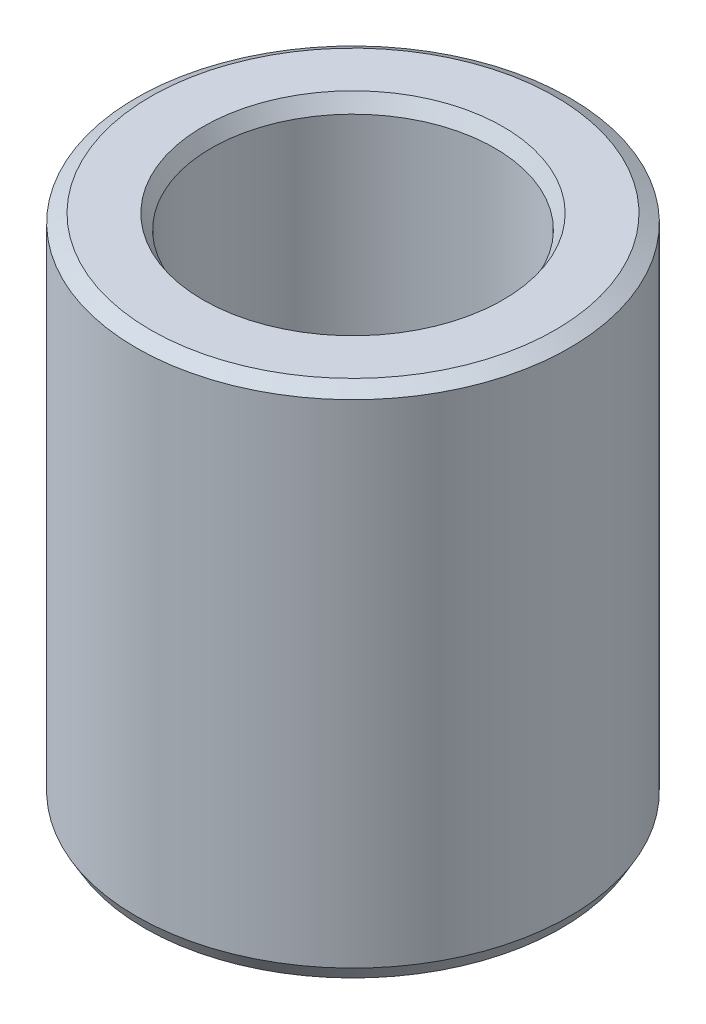
ISO-10303-21;
HEADER;
FILE_DESCRIPTION(('STEP AP214'),'2;1');
FILE_NAME('part.step','',(''),(''),'','','');
FILE_SCHEMA(('AUTOMOTIVE_DESIGN { 1 0 10303 214 1 1 1 1 }'));
ENDSEC;
DATA;
#1=APPLICATION_CONTEXT('core data for automotive mechanical design processes');
#2=APPLICATION_PROTOCOL_DEFINITION('international standard','automotive_design',2000,#1);
#3=PRODUCT_CONTEXT('',#1,'mechanical');
#4=PRODUCT('Part','Part','',(#3));
#5=PRODUCT_RELATED_PRODUCT_CATEGORY('part','',(#4));
#6=PRODUCT_DEFINITION_FORMATION('','',#4);
#7=PRODUCT_DEFINITION_CONTEXT('part definition',#1,'design');
#8=PRODUCT_DEFINITION('design','',#6,#7);
#9=PRODUCT_DEFINITION_SHAPE('','',#8);
#10=(LENGTH_UNIT() NAMED_UNIT(*) SI_UNIT(.MILLI.,.METRE.));
#11=(NAMED_UNIT(*) PLANE_ANGLE_UNIT() SI_UNIT($,.RADIAN.));
#12=(NAMED_UNIT(*) SI_UNIT($,.STERADIAN.) SOLID_ANGLE_UNIT());
#13=UNCERTAINTY_MEASURE_WITH_UNIT(LENGTH_MEASURE(1.E-05),#10,'distance_accuracy_value','');
#14=(GEOMETRIC_REPRESENTATION_CONTEXT(3) GLOBAL_UNCERTAINTY_ASSIGNED_CONTEXT((#13)) GLOBAL_UNIT_ASSIGNED_CONTEXT((#10,
#11,#12)) REPRESENTATION_CONTEXT('',''));
#15=CARTESIAN_POINT('',(0.,0.,0.));
#16=DIRECTION('',(0.,0.,1.));
#17=DIRECTION('',(1.,0.,0.));
#18=AXIS2_PLACEMENT_3D('',#15,#16,#17);
#19=CARTESIAN_POINT('',(0.,130.741757189892,0.));
#20=DIRECTION('',(0.,-1.,0.));
#21=DIRECTION('',(0.,0.,-1.));
#22=AXIS2_PLACEMENT_3D('',#19,#20,#21);
#23=CYLINDRICAL_SURFACE('',#22,55.);
#24=CARTESIAN_POINT('',(0.,3.65298031616579,0.));
#25=DIRECTION('',(0.,1.,0.));
#26=DIRECTION('',(0.,0.,1.));
#27=AXIS2_PLACEMENT_3D('',#24,#25,#26);
#28=CIRCLE('',#27,55.);
#29=CARTESIAN_POINT('',(0.,3.65298031616579,55.));
#30=VERTEX_POINT('',#29);
#31=EDGE_CURVE('E10',#30,#30,#28,.T.);
#32=ORIENTED_EDGE('',*,*,#31,.T.);
#33=EDGE_LOOP('',(#32));
#34=FACE_BOUND('',#33,.T.);
#35=CARTESIAN_POINT('',(0.,128.632708021009,0.));
#36=DIRECTION('',(0.,1.,0.));
#37=DIRECTION('',(0.,0.,1.));
#38=AXIS2_PLACEMENT_3D('',#35,#36,#37);
#39=CIRCLE('',#38,55.);
#40=CARTESIAN_POINT('',(0.,128.632708021009,55.));
#41=VERTEX_POINT('',#40);
#42=EDGE_CURVE('E50',#41,#41,#39,.F.);
#43=ORIENTED_EDGE('',*,*,#42,.T.);
#44=EDGE_LOOP('',(#43));
#45=FACE_BOUND('',#44,.T.);
#46=ADVANCED_FACE('F39',(#34,#45),#23,.T.);
#47=CARTESIAN_POINT('',(0.,130.741757189892,0.));
#48=DIRECTION('',(0.,1.,0.));
#49=DIRECTION('',(0.,0.,1.));
#50=AXIS2_PLACEMENT_3D('',#47,#48,#49);
#51=PLANE('',#50);
#52=CARTESIAN_POINT('',(0.,130.741757189892,0.));
#53=DIRECTION('',(0.,1.,0.));
#54=DIRECTION('',(0.,0.,1.));
#55=AXIS2_PLACEMENT_3D('',#52,#53,#54);
#56=CIRCLE('',#55,38.0900434765867);
#57=CARTESIAN_POINT('',(0.,130.741757189891,38.0900434765867));
#58=VERTEX_POINT('',#57);
#59=EDGE_CURVE('E58',#58,#58,#56,.F.);
#60=ORIENTED_EDGE('',*,*,#59,.T.);
#61=EDGE_LOOP('',(#60));
#62=FACE_BOUND('',#61,.T.);
#63=CARTESIAN_POINT('',(0.,130.741757189892,0.));
#64=DIRECTION('',(0.,1.,0.));
#65=DIRECTION('',(0.,0.,1.));
#66=AXIS2_PLACEMENT_3D('',#63,#64,#65);
#67=CIRCLE('',#66,51.3470196838343);
#68=CARTESIAN_POINT('',(0.,130.741757189892,51.3470196838343));
#69=VERTEX_POINT('',#68);
#70=EDGE_CURVE('E61',#69,#69,#67,.T.);
#71=ORIENTED_EDGE('',*,*,#70,.T.);
#72=EDGE_LOOP('',(#71));
#73=FACE_BOUND('',#72,.T.);
#74=ADVANCED_FACE('F88',(#62,#73),#51,.T.);
#75=CARTESIAN_POINT('',(0.,0.,0.));
#76=DIRECTION('',(0.,1.,0.));
#77=DIRECTION('',(0.,0.,1.));
#78=AXIS2_PLACEMENT_3D('',#75,#76,#77);
#79=PLANE('',#78);
#80=CARTESIAN_POINT('',(0.,0.,0.));
#81=DIRECTION('',(0.,1.,0.));
#82=DIRECTION('',(0.,0.,1.));
#83=AXIS2_PLACEMENT_3D('',#80,#81,#82);
#84=CIRCLE('',#83,39.6339746238697);
#85=CARTESIAN_POINT('',(0.,0.,39.6339746238697));
#86=VERTEX_POINT('',#85);
#87=EDGE_CURVE('E51',#86,#86,#84,.T.);
#88=ORIENTED_EDGE('',*,*,#87,.T.);
#89=EDGE_LOOP('',(#88));
#90=FACE_BOUND('',#89,.T.);
#91=CARTESIAN_POINT('',(0.,0.,0.));
#92=DIRECTION('',(0.,1.,0.));
#93=DIRECTION('',(0.,0.,1.));
#94=AXIS2_PLACEMENT_3D('',#91,#92,#93);
#95=CIRCLE('',#94,52.8909508311173);
#96=CARTESIAN_POINT('',(0.,0.,52.8909508311173));
#97=VERTEX_POINT('',#96);
#98=EDGE_CURVE('E54',#97,#97,#95,.F.);
#99=ORIENTED_EDGE('',*,*,#98,.T.);
#100=EDGE_LOOP('',(#99));
#101=FACE_BOUND('',#100,.T.);
#102=ADVANCED_FACE('F83',(#90,#101),#79,.F.);
#103=CARTESIAN_POINT('',(0.,130.741757189892,0.));
#104=DIRECTION('',(0.,-1.,0.));
#105=DIRECTION('',(0.,0.,-1.));
#106=AXIS2_PLACEMENT_3D('',#103,#104,#105);
#107=CYLINDRICAL_SURFACE('',#106,35.980994307704);
#108=CARTESIAN_POINT('',(0.,127.088776873726,0.));
#109=DIRECTION('',(0.,1.,0.));
#110=DIRECTION('',(0.,0.,1.));
#111=AXIS2_PLACEMENT_3D('',#108,#109,#110);
#112=CIRCLE('',#111,35.980994307704);
#113=CARTESIAN_POINT('',(0.,127.088776873726,35.980994307704));
#114=VERTEX_POINT('',#113);
#115=EDGE_CURVE('E67',#114,#114,#112,.T.);
#116=ORIENTED_EDGE('',*,*,#115,.T.);
#117=EDGE_LOOP('',(#116));
#118=FACE_BOUND('',#117,.T.);
#119=CARTESIAN_POINT('',(0.,2.10904916888272,0.));
#120=DIRECTION('',(0.,1.,0.));
#121=DIRECTION('',(0.,0.,1.));
#122=AXIS2_PLACEMENT_3D('',#119,#120,#121);
#123=CIRCLE('',#122,35.980994307704);
#124=CARTESIAN_POINT('',(0.,2.10904916888272,35.980994307704));
#125=VERTEX_POINT('',#124);
#126=EDGE_CURVE('E69',#125,#125,#123,.F.);
#127=ORIENTED_EDGE('',*,*,#126,.T.);
#128=EDGE_LOOP('',(#127));
#129=FACE_BOUND('',#128,.T.);
#130=ADVANCED_FACE('F71',(#118,#129),#107,.F.);
#131=CARTESIAN_POINT('',(0.,127.088776873726,0.));
#132=DIRECTION('',(0.,1.,0.));
#133=DIRECTION('',(0.,0.,1.));
#134=AXIS2_PLACEMENT_3D('',#131,#132,#133);
#135=CONICAL_SURFACE('',#134,35.980994307704,0.523598775598302);
#136=CARTESIAN_POINT('',(0.,130.741757189891,38.0900434765867));
#137=CARTESIAN_POINT('',(0.,130.703705311598,38.0680742144109));
#138=CARTESIAN_POINT('',(0.,130.665653433305,38.046104952235));
#139=CARTESIAN_POINT('',(0.,130.589549676718,38.0021664278833));
#140=CARTESIAN_POINT('',(0.,130.551497798425,37.9801971657074));
#141=CARTESIAN_POINT('',(0.,130.475394041838,37.9362586413557));
#142=CARTESIAN_POINT('',(0.,130.437342163544,37.9142893791798));
#143=CARTESIAN_POINT('',(0.,130.361238406958,37.8703508548281));
#144=CARTESIAN_POINT('',(0.,130.323186528664,37.8483815926523));
#145=CARTESIAN_POINT('',(0.,130.247082772077,37.8044430683005));
#146=CARTESIAN_POINT('',(0.,130.209030893784,37.7824738061247));
#147=CARTESIAN_POINT('',(0.,130.132927137197,37.7385352817729));
#148=CARTESIAN_POINT('',(0.,130.094875258904,37.7165660195971));
#149=CARTESIAN_POINT('',(0.,130.018771502317,37.6726274952454));
#150=CARTESIAN_POINT('',(0.,129.980719624024,37.6506582330695));
#151=CARTESIAN_POINT('',(0.,129.904615867437,37.6067197087178));
#152=CARTESIAN_POINT('',(0.,129.866563989143,37.5847504465419));
#153=CARTESIAN_POINT('',(0.,129.790460232557,37.5408119221902));
#154=CARTESIAN_POINT('',(0.,129.752408354263,37.5188426600143));
#155=CARTESIAN_POINT('',(0.,129.676304597676,37.4749041356626));
#156=CARTESIAN_POINT('',(0.,129.638252719383,37.4529348734867));
#157=CARTESIAN_POINT('',(0.,129.562148962796,37.408996349135));
#158=CARTESIAN_POINT('',(0.,129.524097084503,37.3870270869592));
#159=CARTESIAN_POINT('',(0.,129.447993327916,37.3430885626074));
#160=CARTESIAN_POINT('',(0.,129.409941449623,37.3211193004316));
#161=CARTESIAN_POINT('',(0.,129.333837693036,37.2771807760799));
#162=CARTESIAN_POINT('',(0.,129.295785814743,37.255211513904));
#163=CARTESIAN_POINT('',(0.,129.219682058156,37.2112729895523));
#164=CARTESIAN_POINT('',(0.,129.181630179862,37.1893037273764));
#165=CARTESIAN_POINT('',(0.,129.105526423276,37.1453652030247));
#166=CARTESIAN_POINT('',(0.,129.067474544982,37.1233959408488));
#167=CARTESIAN_POINT('',(0.,128.991370788395,37.0794574164971));
#168=CARTESIAN_POINT('',(0.,128.953318910102,37.0574881543212));
#169=CARTESIAN_POINT('',(0.,128.877215153515,37.0135496299695));
#170=CARTESIAN_POINT('',(0.,128.839163275222,36.9915803677936));
#171=CARTESIAN_POINT('',(0.,128.763059518635,36.9476418434419));
#172=CARTESIAN_POINT('',(0.,128.725007640342,36.9256725812661));
#173=CARTESIAN_POINT('',(0.,128.648903883755,36.8817340569143));
#174=CARTESIAN_POINT('',(0.,128.610852005461,36.8597647947385));
#175=CARTESIAN_POINT('',(0.,128.534748248875,36.8158262703868));
#176=CARTESIAN_POINT('',(0.,128.496696370581,36.7938570082109));
#177=CARTESIAN_POINT('',(0.,128.420592613994,36.7499184838592));
#178=CARTESIAN_POINT('',(0.,128.382540735701,36.7279492216833));
#179=CARTESIAN_POINT('',(0.,128.306436979114,36.6840106973316));
#180=CARTESIAN_POINT('',(0.,128.268385100821,36.6620414351557));
#181=CARTESIAN_POINT('',(0.,128.192281344234,36.618102910804));
#182=CARTESIAN_POINT('',(0.,128.154229465941,36.5961336486281));
#183=CARTESIAN_POINT('',(0.,128.078125709354,36.5521951242764));
#184=CARTESIAN_POINT('',(0.,128.040073831061,36.5302258621006));
#185=CARTESIAN_POINT('',(0.,127.963970074474,36.4862873377488));
#186=CARTESIAN_POINT('',(0.,127.92591819618,36.464318075573));
#187=CARTESIAN_POINT('',(0.,127.849814439594,36.4203795512212));
#188=CARTESIAN_POINT('',(0.,127.8117625613,36.3984102890454));
#189=CARTESIAN_POINT('',(0.,127.735658804713,36.3544717646937));
#190=CARTESIAN_POINT('',(0.,127.69760692642,36.3325025025178));
#191=CARTESIAN_POINT('',(0.,127.621503169833,36.2885639781661));
#192=CARTESIAN_POINT('',(0.,127.58345129154,36.2665947159902));
#193=CARTESIAN_POINT('',(0.,127.507347534953,36.2226561916385));
#194=CARTESIAN_POINT('',(0.,127.46929565666,36.2006869294626));
#195=CARTESIAN_POINT('',(0.,127.393191900073,36.1567484051109));
#196=CARTESIAN_POINT('',(0.,127.355140021779,36.134779142935));
#197=CARTESIAN_POINT('',(0.,127.279036265193,36.0908406185833));
#198=CARTESIAN_POINT('',(0.,127.240984386899,36.0688713564074));
#199=CARTESIAN_POINT('',(0.,127.164880630312,36.0249328320557));
#200=CARTESIAN_POINT('',(0.,127.126828752019,36.0029635698799));
#201=CARTESIAN_POINT('',(0.,127.088776873726,35.980994307704));
#202=B_SPLINE_CURVE_WITH_KNOTS('',3,(#136,#137,#138,#139,#140,#141,#142,#143,#144,#145,#146,
#147,#148,#149,#150,#151,#152,#153,#154,#155,#156,#157,#158,#159,#160,#161,#162,#163,#164,#165,
#166,#167,#168,#169,#170,#171,#172,#173,#174,#175,#176,#177,#178,#179,#180,#181,#182,#183,#184,
#185,#186,#187,#188,#189,#190,#191,#192,#193,#194,#195,#196,#197,#198,#199,#200,#201),
.UNSPECIFIED.,.F.,.F.,(4,2,2,2,2,2,2,2,2,2,2,2,2,2,2,2,2,2,2,2,2,2,2,2,2,2,2,2,2,2,2,2,4),(0.,
0.131815573055173,0.263631146110342,0.395446719165511,0.52726229222068,0.659077865275853,
0.790893438331022,0.922709011386194,1.05452458444136,1.18634015749653,1.31815573055171,
1.44997130360687,1.58178687666204,1.71360244971722,1.84541802277239,1.97723359582756,
2.10904916888273,2.2408647419379,2.37268031499307,2.50449588804824,2.63631146110341,
2.76812703415858,2.89994260721375,3.03175818026892,3.16357375332409,3.29538932637926,
3.42720489943443,3.5590204724896,3.69083604554477,3.82265161859994,3.95446719165511,
4.08628276471028,4.21809833776543),.UNSPECIFIED.);
#203=EDGE_CURVE('BSEAM77',#58,#114,#202,.T.);
#204=ORIENTED_EDGE('',*,*,#59,.F.);
#205=ORIENTED_EDGE('',*,*,#115,.F.);
#206=ORIENTED_EDGE('',*,*,#203,.T.);
#207=ORIENTED_EDGE('',*,*,#203,.F.);
#208=EDGE_LOOP('',(#204,#206,#205,#207));
#209=FACE_BOUND('',#208,.T.);
#210=ADVANCED_FACE('F77',(#209),#135,.F.);
#211=CARTESIAN_POINT('',(0.,0.,0.));
#212=DIRECTION('',(0.,-1.,0.));
#213=DIRECTION('',(0.,0.,-1.));
#214=AXIS2_PLACEMENT_3D('',#211,#212,#213);
#215=CONICAL_SURFACE('',#214,39.6339746238697,1.04719755119659);
#216=ORIENTED_EDGE('',*,*,#126,.F.);
#217=EDGE_LOOP('',(#216));
#218=FACE_BOUND('',#217,.T.);
#219=ORIENTED_EDGE('',*,*,#87,.F.);
#220=EDGE_LOOP('',(#219));
#221=FACE_BOUND('',#220,.T.);
#222=ADVANCED_FACE('F73',(#218,#221),#215,.F.);
#223=CARTESIAN_POINT('',(0.,3.65298031616579,0.));
#224=DIRECTION('',(0.,1.,0.));
#225=DIRECTION('',(0.,0.,1.));
#226=AXIS2_PLACEMENT_3D('',#223,#224,#225);
#227=CONICAL_SURFACE('',#226,55.,0.5235987755983);
#228=CARTESIAN_POINT('',(0.,0.,52.8909508311173));
#229=CARTESIAN_POINT('',(0.,0.0380518782933947,52.9129200932931));
#230=CARTESIAN_POINT('',(0.,0.0761037565867878,52.934889355469));
#231=CARTESIAN_POINT('',(0.,0.152207513173574,52.9788278798207));
#232=CARTESIAN_POINT('',(0.,0.190259391466967,53.0007971419966));
#233=CARTESIAN_POINT('',(0.,0.266363148053754,53.0447356663483));
#234=CARTESIAN_POINT('',(0.,0.304415026347148,53.0667049285242));
#235=CARTESIAN_POINT('',(0.,0.380518782933936,53.1106434528759));
#236=CARTESIAN_POINT('',(0.,0.418570661227329,53.1326127150517));
#237=CARTESIAN_POINT('',(0.,0.494674417814117,53.1765512394035));
#238=CARTESIAN_POINT('',(0.,0.532726296107511,53.1985205015793));
#239=CARTESIAN_POINT('',(0.,0.608830052694298,53.2424590259311));
#240=CARTESIAN_POINT('',(0.,0.646881930987691,53.2644282881069));
#241=CARTESIAN_POINT('',(0.,0.722985687574478,53.3083668124586));
#242=CARTESIAN_POINT('',(0.,0.761037565867872,53.3303360746345));
#243=CARTESIAN_POINT('',(0.,0.83714132245466,53.3742745989862));
#244=CARTESIAN_POINT('',(0.,0.875193200748054,53.3962438611621));
#245=CARTESIAN_POINT('',(0.,0.951296957334841,53.4401823855138));
#246=CARTESIAN_POINT('',(0.,0.989348835628233,53.4621516476897));
#247=CARTESIAN_POINT('',(0.,1.06545259221502,53.5060901720414));
#248=CARTESIAN_POINT('',(0.,1.10350447050841,53.5280594342173));
#249=CARTESIAN_POINT('',(0.,1.1796082270952,53.571997958569));
#250=CARTESIAN_POINT('',(0.,1.2176601053886,53.5939672207448));
#251=CARTESIAN_POINT('',(0.,1.29376386197538,53.6379057450966));
#252=CARTESIAN_POINT('',(0.,1.33181574026878,53.6598750072724));
#253=CARTESIAN_POINT('',(0.,1.40791949685556,53.7038135316242));
#254=CARTESIAN_POINT('',(0.,1.44597137514896,53.7257827938));
#255=CARTESIAN_POINT('',(0.,1.52207513173574,53.7697213181517));
#256=CARTESIAN_POINT('',(0.,1.56012701002914,53.7916905803276));
#257=CARTESIAN_POINT('',(0.,1.63623076661593,53.8356291046793));
#258=CARTESIAN_POINT('',(0.,1.67428264490932,53.8575983668552));
#259=CARTESIAN_POINT('',(0.,1.75038640149611,53.9015368912069));
#260=CARTESIAN_POINT('',(0.,1.7884382797895,53.9235061533828));
#261=CARTESIAN_POINT('',(0.,1.86454203637629,53.9674446777345));
#262=CARTESIAN_POINT('',(0.,1.90259391466968,53.9894139399104));
#263=CARTESIAN_POINT('',(0.,1.97869767125647,54.0333524642621));
#264=CARTESIAN_POINT('',(0.,2.01674954954986,54.0553217264379));
#265=CARTESIAN_POINT('',(0.,2.09285330613665,54.0992602507897));
#266=CARTESIAN_POINT('',(0.,2.13090518443004,54.1212295129655));
#267=CARTESIAN_POINT('',(0.,2.20700894101683,54.1651680373173));
#268=CARTESIAN_POINT('',(0.,2.24506081931022,54.1871372994931));
#269=CARTESIAN_POINT('',(0.,2.32116457589701,54.2310758238448));
#270=CARTESIAN_POINT('',(0.,2.3592164541904,54.2530450860207));
#271=CARTESIAN_POINT('',(0.,2.43532021077719,54.2969836103724));
#272=CARTESIAN_POINT('',(0.,2.47337208907059,54.3189528725483));
#273=CARTESIAN_POINT('',(0.,2.54947584565737,54.3628913969));
#274=CARTESIAN_POINT('',(0.,2.58752772395077,54.3848606590759));
#275=CARTESIAN_POINT('',(0.,2.66363148053755,54.4287991834276));
#276=CARTESIAN_POINT('',(0.,2.70168335883095,54.4507684456035));
#277=CARTESIAN_POINT('',(0.,2.77778711541773,54.4947069699552));
#278=CARTESIAN_POINT('',(0.,2.81583899371113,54.516676232131));
#279=CARTESIAN_POINT('',(0.,2.89194275029791,54.5606147564828));
#280=CARTESIAN_POINT('',(0.,2.92999462859131,54.5825840186586));
#281=CARTESIAN_POINT('',(0.,3.0060983851781,54.6265225430103));
#282=CARTESIAN_POINT('',(0.,3.04415026347149,54.6484918051862));
#283=CARTESIAN_POINT('',(0.,3.12025402005828,54.6924303295379));
#284=CARTESIAN_POINT('',(0.,3.15830589835167,54.7143995917138));
#285=CARTESIAN_POINT('',(0.,3.23440965493846,54.7583381160655));
#286=CARTESIAN_POINT('',(0.,3.27246153323185,54.7803073782414));
#287=CARTESIAN_POINT('',(0.,3.34856528981864,54.8242459025931));
#288=CARTESIAN_POINT('',(0.,3.38661716811203,54.846215164769));
#289=CARTESIAN_POINT('',(0.,3.46272092469882,54.8901536891207));
#290=CARTESIAN_POINT('',(0.,3.50077280299221,54.9121229512966));
#291=CARTESIAN_POINT('',(0.,3.576876559579,54.9560614756483));
#292=CARTESIAN_POINT('',(0.,3.61492843787239,54.9780307378241));
#293=CARTESIAN_POINT('',(0.,3.65298031616579,55.));
#294=B_SPLINE_CURVE_WITH_KNOTS('',3,(#228,#229,#230,#231,#232,#233,#234,#235,#236,#237,#238,
#239,#240,#241,#242,#243,#244,#245,#246,#247,#248,#249,#250,#251,#252,#253,#254,#255,#256,#257,
#258,#259,#260,#261,#262,#263,#264,#265,#266,#267,#268,#269,#270,#271,#272,#273,#274,#275,#276,
#277,#278,#279,#280,#281,#282,#283,#284,#285,#286,#287,#288,#289,#290,#291,#292,#293),
.UNSPECIFIED.,.F.,.F.,(4,2,2,2,2,2,2,2,2,2,2,2,2,2,2,2,2,2,2,2,2,2,2,2,2,2,2,2,2,2,2,2,4),(0.,
0.131815573055169,0.263631146110342,0.395446719165511,0.52726229222068,0.659077865275849,
0.790893438331022,0.922709011386191,1.05452458444136,1.18634015749653,1.3181557305517,
1.44997130360687,1.58178687666204,1.71360244971721,1.84541802277238,1.97723359582756,
2.10904916888272,2.24086474193789,2.37268031499307,2.50449588804824,2.63631146110341,
2.76812703415858,2.89994260721375,3.03175818026892,3.16357375332409,3.29538932637926,
3.42720489943443,3.5590204724896,3.69083604554477,3.82265161859994,3.95446719165511,
4.08628276471028,4.21809833776545),.UNSPECIFIED.);
#295=EDGE_CURVE('BSEAM76',#97,#30,#294,.T.);
#296=ORIENTED_EDGE('',*,*,#98,.F.);
#297=ORIENTED_EDGE('',*,*,#31,.F.);
#298=ORIENTED_EDGE('',*,*,#295,.T.);
#299=ORIENTED_EDGE('',*,*,#295,.F.);
#300=EDGE_LOOP('',(#296,#298,#297,#299));
#301=FACE_BOUND('',#300,.T.);
#302=ADVANCED_FACE('F76',(#301),#227,.T.);
#303=CARTESIAN_POINT('',(0.,130.741757189892,0.));
#304=DIRECTION('',(0.,-1.,0.));
#305=DIRECTION('',(0.,0.,-1.));
#306=AXIS2_PLACEMENT_3D('',#303,#304,#305);
#307=CONICAL_SURFACE('',#306,51.3470196838343,1.04719755119659);
#308=ORIENTED_EDGE('',*,*,#42,.F.);
#309=EDGE_LOOP('',(#308));
#310=FACE_BOUND('',#309,.T.);
#311=ORIENTED_EDGE('',*,*,#70,.F.);
#312=EDGE_LOOP('',(#311));
#313=FACE_BOUND('',#312,.T.);
#314=ADVANCED_FACE('F45',(#310,#313),#307,.T.);
#315=CLOSED_SHELL('',(#46,#74,#102,#130,#210,#222,#302,#314));
#316=MANIFOLD_SOLID_BREP('B2',#315);
#317=ADVANCED_BREP_SHAPE_REPRESENTATION('',(#18,#316),#14);
#318=SHAPE_DEFINITION_REPRESENTATION(#9,#317);
ENDSEC;
END-ISO-10303-21;
